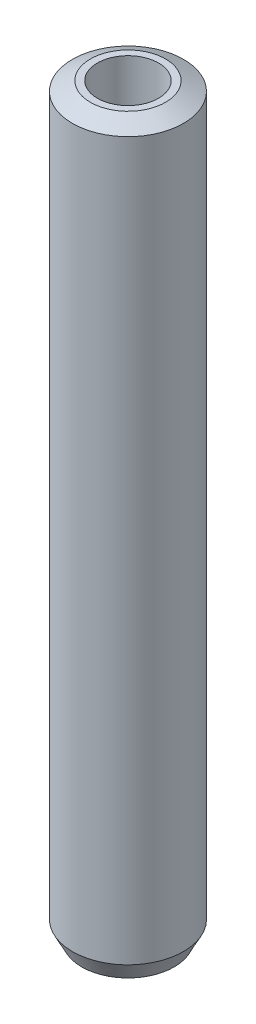
ISO-10303-21;
HEADER;
FILE_DESCRIPTION(('STEP AP214'),'2;1');
FILE_NAME('part.step','',(''),(''),'','','');
FILE_SCHEMA(('AUTOMOTIVE_DESIGN { 1 0 10303 214 1 1 1 1 }'));
ENDSEC;
DATA;
#1=APPLICATION_CONTEXT('core data for automotive mechanical design processes');
#2=APPLICATION_PROTOCOL_DEFINITION('international standard','automotive_design',2000,#1);
#3=PRODUCT_CONTEXT('',#1,'mechanical');
#4=PRODUCT('Part','Part','',(#3));
#5=PRODUCT_RELATED_PRODUCT_CATEGORY('part','',(#4));
#6=PRODUCT_DEFINITION_FORMATION('','',#4);
#7=PRODUCT_DEFINITION_CONTEXT('part definition',#1,'design');
#8=PRODUCT_DEFINITION('design','',#6,#7);
#9=PRODUCT_DEFINITION_SHAPE('','',#8);
#10=(LENGTH_UNIT() NAMED_UNIT(*) SI_UNIT(.MILLI.,.METRE.));
#11=(NAMED_UNIT(*) PLANE_ANGLE_UNIT() SI_UNIT($,.RADIAN.));
#12=(NAMED_UNIT(*) SI_UNIT($,.STERADIAN.) SOLID_ANGLE_UNIT());
#13=UNCERTAINTY_MEASURE_WITH_UNIT(LENGTH_MEASURE(1.E-05),#10,'distance_accuracy_value','');
#14=(GEOMETRIC_REPRESENTATION_CONTEXT(3) GLOBAL_UNCERTAINTY_ASSIGNED_CONTEXT((#13)) GLOBAL_UNIT_ASSIGNED_CONTEXT((#10,
#11,#12)) REPRESENTATION_CONTEXT('',''));
#15=CARTESIAN_POINT('',(0.,0.,0.));
#16=DIRECTION('',(0.,0.,1.));
#17=DIRECTION('',(1.,0.,0.));
#18=AXIS2_PLACEMENT_3D('',#15,#16,#17);
#19=CARTESIAN_POINT('',(0.,301.557135636101,0.));
#20=DIRECTION('',(0.,-1.,0.));
#21=DIRECTION('',(0.,0.,-1.));
#22=AXIS2_PLACEMENT_3D('',#19,#20,#21);
#23=CYLINDRICAL_SURFACE('',#22,22.5);
#24=CARTESIAN_POINT('',(0.,297.795270397526,0.));
#25=DIRECTION('',(0.,1.,0.));
#26=DIRECTION('',(0.,0.,1.));
#27=AXIS2_PLACEMENT_3D('',#24,#25,#26);
#28=CIRCLE('',#27,22.5);
#29=CARTESIAN_POINT('',(0.,297.795270397526,22.5));
#30=VERTEX_POINT('',#29);
#31=EDGE_CURVE('E50',#30,#30,#28,.F.);
#32=ORIENTED_EDGE('',*,*,#31,.T.);
#33=EDGE_LOOP('',(#32));
#34=FACE_BOUND('',#33,.T.);
#35=CARTESIAN_POINT('',(0.,7.27996416880738,0.));
#36=DIRECTION('',(0.,1.,0.));
#37=DIRECTION('',(0.,0.,1.));
#38=AXIS2_PLACEMENT_3D('',#35,#36,#37);
#39=CIRCLE('',#38,22.5);
#40=CARTESIAN_POINT('',(0.,7.27996416880738,22.5));
#41=VERTEX_POINT('',#40);
#42=EDGE_CURVE('E51',#41,#41,#39,.T.);
#43=ORIENTED_EDGE('',*,*,#42,.T.);
#44=EDGE_LOOP('',(#43));
#45=FACE_BOUND('',#44,.T.);
#46=ADVANCED_FACE('F39',(#34,#45),#23,.T.);
#47=CARTESIAN_POINT('',(0.,301.557135636101,0.));
#48=DIRECTION('',(0.,1.,0.));
#49=DIRECTION('',(0.,0.,1.));
#50=AXIS2_PLACEMENT_3D('',#47,#48,#49);
#51=PLANE('',#50);
#52=CARTESIAN_POINT('',(0.,301.557135636101,0.));
#53=DIRECTION('',(0.,1.,0.));
#54=DIRECTION('',(0.,0.,1.));
#55=AXIS2_PLACEMENT_3D('',#52,#53,#54);
#56=CIRCLE('',#55,15.2200358311923);
#57=CARTESIAN_POINT('',(0.,301.557135636101,15.2200358311923));
#58=VERTEX_POINT('',#57);
#59=EDGE_CURVE('E54',#58,#58,#56,.T.);
#60=ORIENTED_EDGE('',*,*,#59,.T.);
#61=EDGE_LOOP('',(#60));
#62=FACE_BOUND('',#61,.T.);
#63=CARTESIAN_POINT('',(0.,301.557135636101,0.));
#64=DIRECTION('',(0.,1.,0.));
#65=DIRECTION('',(0.,0.,1.));
#66=AXIS2_PLACEMENT_3D('',#63,#64,#65);
#67=CIRCLE('',#66,12.3939221263106);
#68=CARTESIAN_POINT('',(0.,301.557135636101,12.3939221263106));
#69=VERTEX_POINT('',#68);
#70=EDGE_CURVE('E58',#69,#69,#67,.T.);
#71=ORIENTED_EDGE('',*,*,#70,.F.);
#72=EDGE_LOOP('',(#71));
#73=FACE_BOUND('',#72,.T.);
#74=ADVANCED_FACE('F69',(#62,#73),#51,.T.);
#75=CARTESIAN_POINT('',(0.,0.,0.));
#76=DIRECTION('',(0.,1.,0.));
#77=DIRECTION('',(0.,0.,1.));
#78=AXIS2_PLACEMENT_3D('',#75,#76,#77);
#79=PLANE('',#78);
#80=CARTESIAN_POINT('',(0.,0.,0.));
#81=DIRECTION('',(0.,1.,0.));
#82=DIRECTION('',(0.,0.,1.));
#83=AXIS2_PLACEMENT_3D('',#80,#81,#82);
#84=CIRCLE('',#83,18.738134761426);
#85=CARTESIAN_POINT('',(0.,0.,18.738134761426));
#86=VERTEX_POINT('',#85);
#87=EDGE_CURVE('E10',#86,#86,#84,.F.);
#88=ORIENTED_EDGE('',*,*,#87,.T.);
#89=EDGE_LOOP('',(#88));
#90=FACE_BOUND('',#89,.T.);
#91=CARTESIAN_POINT('',(0.,0.,0.));
#92=DIRECTION('',(0.,1.,0.));
#93=DIRECTION('',(0.,0.,1.));
#94=AXIS2_PLACEMENT_3D('',#91,#92,#93);
#95=CIRCLE('',#94,12.3939221263106);
#96=CARTESIAN_POINT('',(0.,0.,12.3939221263106));
#97=VERTEX_POINT('',#96);
#98=EDGE_CURVE('E63',#97,#97,#95,.T.);
#99=ORIENTED_EDGE('',*,*,#98,.T.);
#100=EDGE_LOOP('',(#99));
#101=FACE_BOUND('',#100,.T.);
#102=ADVANCED_FACE('F75',(#90,#101),#79,.F.);
#103=CARTESIAN_POINT('',(0.,301.557135636101,0.));
#104=DIRECTION('',(0.,-1.,0.));
#105=DIRECTION('',(0.,0.,-1.));
#106=AXIS2_PLACEMENT_3D('',#103,#104,#105);
#107=CYLINDRICAL_SURFACE('',#106,12.3939221263106);
#108=ORIENTED_EDGE('',*,*,#70,.T.);
#109=EDGE_LOOP('',(#108));
#110=FACE_BOUND('',#109,.T.);
#111=ORIENTED_EDGE('',*,*,#98,.F.);
#112=EDGE_LOOP('',(#111));
#113=FACE_BOUND('',#112,.T.);
#114=ADVANCED_FACE('F70',(#110,#113),#107,.F.);
#115=CARTESIAN_POINT('',(0.,301.557135636101,0.));
#116=DIRECTION('',(0.,-1.,0.));
#117=DIRECTION('',(0.,0.,-1.));
#118=AXIS2_PLACEMENT_3D('',#115,#116,#117);
#119=CONICAL_SURFACE('',#118,15.2200358311923,1.09384478412735);
#120=ORIENTED_EDGE('',*,*,#31,.F.);
#121=EDGE_LOOP('',(#120));
#122=FACE_BOUND('',#121,.T.);
#123=ORIENTED_EDGE('',*,*,#59,.F.);
#124=EDGE_LOOP('',(#123));
#125=FACE_BOUND('',#124,.T.);
#126=ADVANCED_FACE('F81',(#122,#125),#119,.T.);
#127=CARTESIAN_POINT('',(0.,7.27996416880738,0.));
#128=DIRECTION('',(0.,1.,0.));
#129=DIRECTION('',(0.,0.,1.));
#130=AXIS2_PLACEMENT_3D('',#127,#128,#129);
#131=CONICAL_SURFACE('',#130,22.5,0.476951542667549);
#132=ORIENTED_EDGE('',*,*,#87,.F.);
#133=EDGE_LOOP('',(#132));
#134=FACE_BOUND('',#133,.T.);
#135=ORIENTED_EDGE('',*,*,#42,.F.);
#136=EDGE_LOOP('',(#135));
#137=FACE_BOUND('',#136,.T.);
#138=ADVANCED_FACE('F45',(#134,#137),#131,.T.);
#139=CLOSED_SHELL('',(#46,#74,#102,#114,#126,#138));
#140=MANIFOLD_SOLID_BREP('B2',#139);
#141=ADVANCED_BREP_SHAPE_REPRESENTATION('',(#18,#140),#14);
#142=SHAPE_DEFINITION_REPRESENTATION(#9,#141);
ENDSEC;
END-ISO-10303-21;
